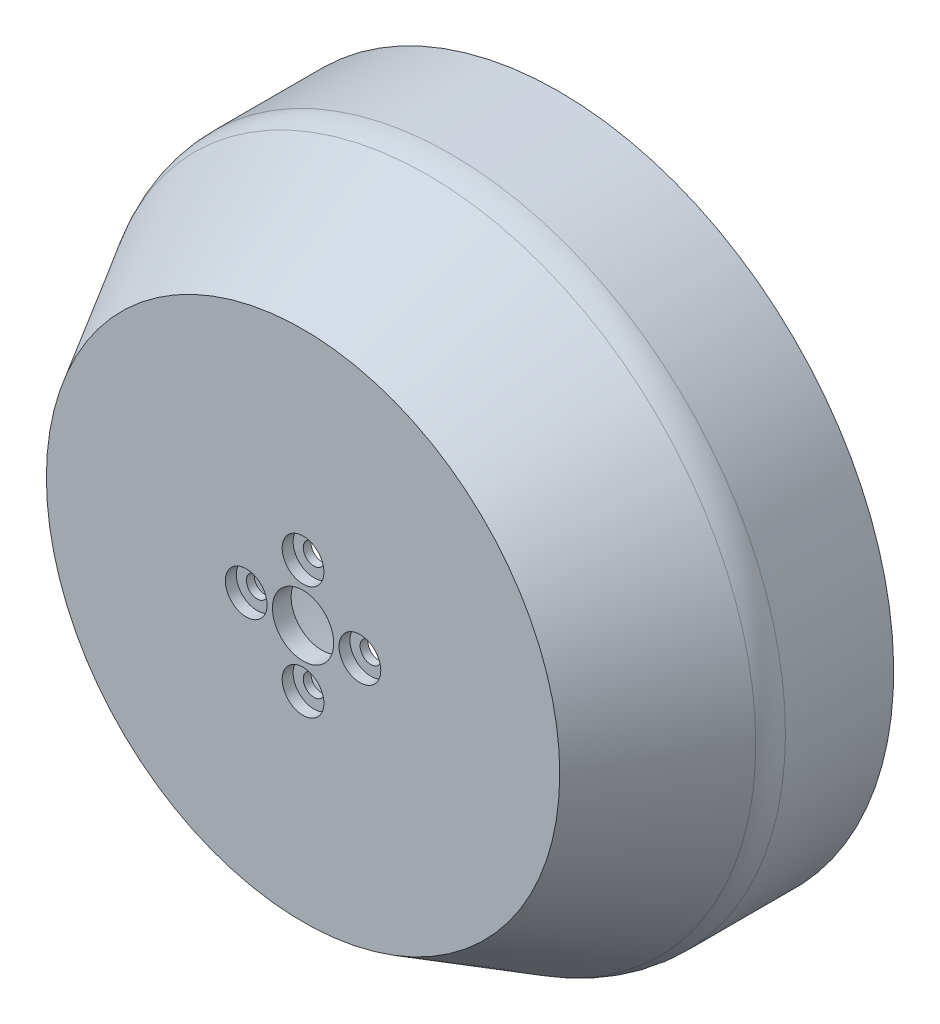
ISO-10303-21;
HEADER;
FILE_DESCRIPTION(('STEP AP214'),'2;1');
FILE_NAME('part.step','',(''),(''),'','','');
FILE_SCHEMA(('AUTOMOTIVE_DESIGN { 1 0 10303 214 1 1 1 1 }'));
ENDSEC;
DATA;
#1=APPLICATION_CONTEXT('core data for automotive mechanical design processes');
#2=APPLICATION_PROTOCOL_DEFINITION('international standard','automotive_design',2000,#1);
#3=PRODUCT_CONTEXT('',#1,'mechanical');
#4=PRODUCT('Part','Part','',(#3));
#5=PRODUCT_RELATED_PRODUCT_CATEGORY('part','',(#4));
#6=PRODUCT_DEFINITION_FORMATION('','',#4);
#7=PRODUCT_DEFINITION_CONTEXT('part definition',#1,'design');
#8=PRODUCT_DEFINITION('design','',#6,#7);
#9=PRODUCT_DEFINITION_SHAPE('','',#8);
#10=(LENGTH_UNIT() NAMED_UNIT(*) SI_UNIT(.MILLI.,.METRE.));
#11=(NAMED_UNIT(*) PLANE_ANGLE_UNIT() SI_UNIT($,.RADIAN.));
#12=(NAMED_UNIT(*) SI_UNIT($,.STERADIAN.) SOLID_ANGLE_UNIT());
#13=UNCERTAINTY_MEASURE_WITH_UNIT(LENGTH_MEASURE(1.E-05),#10,'distance_accuracy_value','');
#14=(GEOMETRIC_REPRESENTATION_CONTEXT(3) GLOBAL_UNCERTAINTY_ASSIGNED_CONTEXT((#13)) GLOBAL_UNIT_ASSIGNED_CONTEXT((#10,
#11,#12)) REPRESENTATION_CONTEXT('',''));
#15=CARTESIAN_POINT('',(0.,0.,0.));
#16=DIRECTION('',(0.,0.,1.));
#17=DIRECTION('',(1.,0.,0.));
#18=AXIS2_PLACEMENT_3D('',#15,#16,#17);
#19=CARTESIAN_POINT('',(16.905,10.,-30.301));
#20=DIRECTION('',(0.,0.,1.));
#21=DIRECTION('',(1.,0.,0.));
#22=AXIS2_PLACEMENT_3D('',#19,#20,#21);
#23=CYLINDRICAL_SURFACE('',#22,1.375);
#24=CARTESIAN_POINT('',(16.905,10.,0.0999999999999994));
#25=DIRECTION('',(0.,0.,1.));
#26=DIRECTION('',(1.,0.,0.));
#27=AXIS2_PLACEMENT_3D('',#24,#25,#26);
#28=CIRCLE('',#27,1.375);
#29=CARTESIAN_POINT('',(18.28,10.,0.0999999999999994));
#30=VERTEX_POINT('',#29);
#31=EDGE_CURVE('E77',#30,#30,#28,.F.);
#32=ORIENTED_EDGE('',*,*,#31,.T.);
#33=EDGE_LOOP('',(#32));
#34=FACE_BOUND('',#33,.T.);
#35=CARTESIAN_POINT('',(16.905,10.,1.1));
#36=DIRECTION('',(0.,0.,1.));
#37=DIRECTION('',(1.,0.,0.));
#38=AXIS2_PLACEMENT_3D('',#35,#36,#37);
#39=CIRCLE('',#38,1.375);
#40=CARTESIAN_POINT('',(18.28,10.,1.1));
#41=VERTEX_POINT('',#40);
#42=EDGE_CURVE('E53',#41,#41,#39,.F.);
#43=ORIENTED_EDGE('',*,*,#42,.F.);
#44=EDGE_LOOP('',(#43));
#45=FACE_BOUND('',#44,.T.);
#46=ADVANCED_FACE('F49',(#34,#45),#23,.F.);
#47=CARTESIAN_POINT('',(9.61999999999999,17.285,-30.301));
#48=DIRECTION('',(0.,0.,1.));
#49=DIRECTION('',(1.,0.,0.));
#50=AXIS2_PLACEMENT_3D('',#47,#48,#49);
#51=CYLINDRICAL_SURFACE('',#50,1.375);
#52=CARTESIAN_POINT('',(9.61999999999999,17.285,0.0999999999999994));
#53=DIRECTION('',(0.,0.,1.));
#54=DIRECTION('',(1.,0.,0.));
#55=AXIS2_PLACEMENT_3D('',#52,#53,#54);
#56=CIRCLE('',#55,1.375);
#57=CARTESIAN_POINT('',(10.995,17.285,0.0999999999999994));
#58=VERTEX_POINT('',#57);
#59=EDGE_CURVE('E81',#58,#58,#56,.F.);
#60=ORIENTED_EDGE('',*,*,#59,.T.);
#61=EDGE_LOOP('',(#60));
#62=FACE_BOUND('',#61,.T.);
#63=CARTESIAN_POINT('',(9.61999999999999,17.285,1.1));
#64=DIRECTION('',(0.,0.,1.));
#65=DIRECTION('',(1.,0.,0.));
#66=AXIS2_PLACEMENT_3D('',#63,#64,#65);
#67=CIRCLE('',#66,1.375);
#68=CARTESIAN_POINT('',(10.995,17.285,1.1));
#69=VERTEX_POINT('',#68);
#70=EDGE_CURVE('E72',#69,#69,#67,.F.);
#71=ORIENTED_EDGE('',*,*,#70,.F.);
#72=EDGE_LOOP('',(#71));
#73=FACE_BOUND('',#72,.T.);
#74=ADVANCED_FACE('F133',(#62,#73),#51,.F.);
#75=CARTESIAN_POINT('',(2.33499999999999,10.,-30.301));
#76=DIRECTION('',(0.,0.,1.));
#77=DIRECTION('',(1.,0.,0.));
#78=AXIS2_PLACEMENT_3D('',#75,#76,#77);
#79=CYLINDRICAL_SURFACE('',#78,1.375);
#80=CARTESIAN_POINT('',(2.33499999999999,10.,0.0999999999999994));
#81=DIRECTION('',(0.,0.,1.));
#82=DIRECTION('',(1.,0.,0.));
#83=AXIS2_PLACEMENT_3D('',#80,#81,#82);
#84=CIRCLE('',#83,1.375);
#85=CARTESIAN_POINT('',(3.70999999999999,10.,0.0999999999999994));
#86=VERTEX_POINT('',#85);
#87=EDGE_CURVE('E86',#86,#86,#84,.F.);
#88=ORIENTED_EDGE('',*,*,#87,.T.);
#89=EDGE_LOOP('',(#88));
#90=FACE_BOUND('',#89,.T.);
#91=CARTESIAN_POINT('',(2.33499999999999,10.,1.1));
#92=DIRECTION('',(0.,0.,1.));
#93=DIRECTION('',(1.,0.,0.));
#94=AXIS2_PLACEMENT_3D('',#91,#92,#93);
#95=CIRCLE('',#94,1.375);
#96=CARTESIAN_POINT('',(3.70999999999999,10.,1.1));
#97=VERTEX_POINT('',#96);
#98=EDGE_CURVE('E69',#97,#97,#95,.F.);
#99=ORIENTED_EDGE('',*,*,#98,.F.);
#100=EDGE_LOOP('',(#99));
#101=FACE_BOUND('',#100,.T.);
#102=ADVANCED_FACE('F138',(#90,#101),#79,.F.);
#103=CARTESIAN_POINT('',(9.61999999999999,2.715,-30.301));
#104=DIRECTION('',(0.,0.,1.));
#105=DIRECTION('',(1.,0.,0.));
#106=AXIS2_PLACEMENT_3D('',#103,#104,#105);
#107=CYLINDRICAL_SURFACE('',#106,1.375);
#108=CARTESIAN_POINT('',(9.61999999999999,2.715,0.0999999999999994));
#109=DIRECTION('',(0.,0.,1.));
#110=DIRECTION('',(1.,0.,0.));
#111=AXIS2_PLACEMENT_3D('',#108,#109,#110);
#112=CIRCLE('',#111,1.375);
#113=CARTESIAN_POINT('',(10.995,2.715,0.0999999999999994));
#114=VERTEX_POINT('',#113);
#115=EDGE_CURVE('E90',#114,#114,#112,.F.);
#116=ORIENTED_EDGE('',*,*,#115,.T.);
#117=EDGE_LOOP('',(#116));
#118=FACE_BOUND('',#117,.T.);
#119=CARTESIAN_POINT('',(9.61999999999999,2.715,1.1));
#120=DIRECTION('',(0.,0.,1.));
#121=DIRECTION('',(1.,0.,0.));
#122=AXIS2_PLACEMENT_3D('',#119,#120,#121);
#123=CIRCLE('',#122,1.375);
#124=CARTESIAN_POINT('',(10.995,2.715,1.1));
#125=VERTEX_POINT('',#124);
#126=EDGE_CURVE('E66',#125,#125,#123,.F.);
#127=ORIENTED_EDGE('',*,*,#126,.F.);
#128=EDGE_LOOP('',(#127));
#129=FACE_BOUND('',#128,.T.);
#130=ADVANCED_FACE('F144',(#118,#129),#107,.F.);
#131=CARTESIAN_POINT('',(9.61999999999999,10.,2.5));
#132=DIRECTION('',(0.,0.,-1.));
#133=DIRECTION('',(-1.,0.,0.));
#134=AXIS2_PLACEMENT_3D('',#131,#132,#133);
#135=CYLINDRICAL_SURFACE('',#134,42.9);
#136=CARTESIAN_POINT('',(9.61999999999999,10.,-16.4282032302755));
#137=DIRECTION('',(0.,0.,1.));
#138=DIRECTION('',(1.,0.,0.));
#139=AXIS2_PLACEMENT_3D('',#136,#137,#138);
#140=CIRCLE('',#139,42.9);
#141=CARTESIAN_POINT('',(52.52,10.,-16.4282032302755));
#142=VERTEX_POINT('',#141);
#143=EDGE_CURVE('E57',#142,#142,#140,.F.);
#144=ORIENTED_EDGE('',*,*,#143,.T.);
#145=EDGE_LOOP('',(#144));
#146=FACE_BOUND('',#145,.T.);
#147=CARTESIAN_POINT('',(9.61999999999999,10.,-30.3));
#148=DIRECTION('',(0.,0.,-1.));
#149=DIRECTION('',(0.,1.,0.));
#150=AXIS2_PLACEMENT_3D('',#147,#148,#149);
#151=CIRCLE('',#150,42.9);
#152=CARTESIAN_POINT('',(9.61999999999999,52.9,-30.3));
#153=VERTEX_POINT('',#152);
#154=EDGE_CURVE('E109',#153,#153,#151,.F.);
#155=ORIENTED_EDGE('',*,*,#154,.T.);
#156=EDGE_LOOP('',(#155));
#157=FACE_BOUND('',#156,.T.);
#158=ADVANCED_FACE('F147',(#146,#157),#135,.T.);
#159=CARTESIAN_POINT('',(9.61999999999999,10.,2.5));
#160=DIRECTION('',(0.,0.,1.));
#161=DIRECTION('',(1.,0.,0.));
#162=AXIS2_PLACEMENT_3D('',#159,#160,#161);
#163=PLANE('',#162);
#164=CARTESIAN_POINT('',(2.33499999999999,10.,2.5));
#165=DIRECTION('',(0.,0.,1.));
#166=DIRECTION('',(1.,0.,0.));
#167=AXIS2_PLACEMENT_3D('',#164,#165,#166);
#168=CIRCLE('',#167,2.675);
#169=CARTESIAN_POINT('',(5.00999999999999,10.,2.5));
#170=VERTEX_POINT('',#169);
#171=EDGE_CURVE('E349',#170,#170,#168,.T.);
#172=ORIENTED_EDGE('',*,*,#171,.F.);
#173=EDGE_LOOP('',(#172));
#174=FACE_BOUND('',#173,.T.);
#175=CARTESIAN_POINT('',(9.61999999999999,2.715,2.5));
#176=DIRECTION('',(0.,0.,1.));
#177=DIRECTION('',(1.,0.,0.));
#178=AXIS2_PLACEMENT_3D('',#175,#176,#177);
#179=CIRCLE('',#178,2.675);
#180=CARTESIAN_POINT('',(12.295,2.715,2.5));
#181=VERTEX_POINT('',#180);
#182=EDGE_CURVE('E343',#181,#181,#179,.T.);
#183=ORIENTED_EDGE('',*,*,#182,.F.);
#184=EDGE_LOOP('',(#183));
#185=FACE_BOUND('',#184,.T.);
#186=CARTESIAN_POINT('',(9.61999999999999,17.285,2.5));
#187=DIRECTION('',(0.,0.,1.));
#188=DIRECTION('',(1.,0.,0.));
#189=AXIS2_PLACEMENT_3D('',#186,#187,#188);
#190=CIRCLE('',#189,2.675);
#191=CARTESIAN_POINT('',(12.295,17.285,2.5));
#192=VERTEX_POINT('',#191);
#193=EDGE_CURVE('E338',#192,#192,#190,.T.);
#194=ORIENTED_EDGE('',*,*,#193,.F.);
#195=EDGE_LOOP('',(#194));
#196=FACE_BOUND('',#195,.T.);
#197=CARTESIAN_POINT('',(16.905,10.,2.5));
#198=DIRECTION('',(0.,0.,1.));
#199=DIRECTION('',(1.,0.,0.));
#200=AXIS2_PLACEMENT_3D('',#197,#198,#199);
#201=CIRCLE('',#200,2.675);
#202=CARTESIAN_POINT('',(19.58,10.,2.5));
#203=VERTEX_POINT('',#202);
#204=EDGE_CURVE('E335',#203,#203,#201,.T.);
#205=ORIENTED_EDGE('',*,*,#204,.F.);
#206=EDGE_LOOP('',(#205));
#207=FACE_BOUND('',#206,.T.);
#208=CARTESIAN_POINT('',(9.61999999999999,10.,2.5));
#209=DIRECTION('',(0.,0.,1.));
#210=DIRECTION('',(1.,0.,0.));
#211=AXIS2_PLACEMENT_3D('',#208,#209,#210);
#212=CIRCLE('',#211,3.925);
#213=CARTESIAN_POINT('',(13.545,10.,2.5));
#214=VERTEX_POINT('',#213);
#215=EDGE_CURVE('E93',#214,#214,#212,.T.);
#216=ORIENTED_EDGE('',*,*,#215,.F.);
#217=EDGE_LOOP('',(#216));
#218=FACE_BOUND('',#217,.T.);
#219=CARTESIAN_POINT('',(9.61999999999999,10.,2.5));
#220=DIRECTION('',(0.,0.,1.));
#221=DIRECTION('',(1.,0.,0.));
#222=AXIS2_PLACEMENT_3D('',#219,#220,#221);
#223=CIRCLE('',#222,32.9);
#224=CARTESIAN_POINT('',(42.52,10.,2.5));
#225=VERTEX_POINT('',#224);
#226=EDGE_CURVE('E62',#225,#225,#223,.T.);
#227=ORIENTED_EDGE('',*,*,#226,.T.);
#228=EDGE_LOOP('',(#227));
#229=FACE_BOUND('',#228,.T.);
#230=ADVANCED_FACE('F118',(#174,#185,#196,#207,#218,#229),#163,.T.);
#231=CARTESIAN_POINT('',(9.61999999999999,10.,-30.3));
#232=DIRECTION('',(0.,0.,-1.));
#233=DIRECTION('',(-1.,0.,0.));
#234=AXIS2_PLACEMENT_3D('',#231,#232,#233);
#235=PLANE('',#234);
#236=CARTESIAN_POINT('',(9.61999999999999,10.,-30.3));
#237=DIRECTION('',(0.,0.,-1.));
#238=DIRECTION('',(0.,1.,0.));
#239=AXIS2_PLACEMENT_3D('',#236,#237,#238);
#240=CIRCLE('',#239,40.5);
#241=CARTESIAN_POINT('',(9.61999999999999,50.5,-30.3));
#242=VERTEX_POINT('',#241);
#243=EDGE_CURVE('E101',#242,#242,#240,.F.);
#244=ORIENTED_EDGE('',*,*,#243,.T.);
#245=EDGE_LOOP('',(#244));
#246=FACE_BOUND('',#245,.T.);
#247=ORIENTED_EDGE('',*,*,#154,.F.);
#248=EDGE_LOOP('',(#247));
#249=FACE_BOUND('',#248,.T.);
#250=ADVANCED_FACE('F122',(#246,#249),#235,.T.);
#251=CARTESIAN_POINT('',(9.61999999999999,10.,2.5));
#252=DIRECTION('',(0.,0.,-1.));
#253=DIRECTION('',(-1.,0.,0.));
#254=AXIS2_PLACEMENT_3D('',#251,#252,#253);
#255=CONICAL_SURFACE('',#254,32.9,0.5235987755983);
#256=CARTESIAN_POINT('',(9.61999999999999,10.,-13.4282032302755));
#257=DIRECTION('',(0.,0.,-1.));
#258=DIRECTION('',(-1.,0.,0.));
#259=AXIS2_PLACEMENT_3D('',#256,#257,#258);
#260=CIRCLE('',#259,42.0961524227066);
#261=CARTESIAN_POINT('',(-32.4761524227066,10.,-13.4282032302755));
#262=VERTEX_POINT('',#261);
#263=EDGE_CURVE('E14',#262,#262,#260,.F.);
#264=ORIENTED_EDGE('',*,*,#263,.T.);
#265=EDGE_LOOP('',(#264));
#266=FACE_BOUND('',#265,.T.);
#267=ORIENTED_EDGE('',*,*,#226,.F.);
#268=EDGE_LOOP('',(#267));
#269=FACE_BOUND('',#268,.T.);
#270=ADVANCED_FACE('F120',(#266,#269),#255,.T.);
#271=CARTESIAN_POINT('',(9.61999999999999,10.,-16.4282032302755));
#272=DIRECTION('',(0.,0.,1.));
#273=DIRECTION('',(1.,0.,0.));
#274=AXIS2_PLACEMENT_3D('',#271,#272,#273);
#275=TOROIDAL_SURFACE('',#274,36.9,6.);
#276=ORIENTED_EDGE('',*,*,#263,.F.);
#277=EDGE_LOOP('',(#276));
#278=FACE_BOUND('',#277,.T.);
#279=ORIENTED_EDGE('',*,*,#143,.F.);
#280=EDGE_LOOP('',(#279));
#281=FACE_BOUND('',#280,.T.);
#282=ADVANCED_FACE('F51',(#278,#281),#275,.T.);
#283=CARTESIAN_POINT('',(9.61999999999999,10.,2.5));
#284=DIRECTION('',(0.,0.,-1.));
#285=DIRECTION('',(-1.,0.,0.));
#286=AXIS2_PLACEMENT_3D('',#283,#284,#285);
#287=CYLINDRICAL_SURFACE('',#286,40.5);
#288=CARTESIAN_POINT('',(9.61999999999999,10.,-16.4282032302755));
#289=DIRECTION('',(0.,0.,-1.));
#290=DIRECTION('',(-1.,0.,0.));
#291=AXIS2_PLACEMENT_3D('',#288,#289,#290);
#292=CIRCLE('',#291,40.5);
#293=CARTESIAN_POINT('',(-30.88,10.,-16.4282032302755));
#294=VERTEX_POINT('',#293);
#295=EDGE_CURVE('E102',#294,#294,#292,.T.);
#296=ORIENTED_EDGE('',*,*,#295,.F.);
#297=EDGE_LOOP('',(#296));
#298=FACE_BOUND('',#297,.T.);
#299=ORIENTED_EDGE('',*,*,#243,.F.);
#300=EDGE_LOOP('',(#299));
#301=FACE_BOUND('',#300,.T.);
#302=ADVANCED_FACE('F127',(#298,#301),#287,.F.);
#303=CARTESIAN_POINT('',(9.61999999999999,10.,0.1));
#304=DIRECTION('',(0.,0.,1.));
#305=DIRECTION('',(1.,0.,0.));
#306=AXIS2_PLACEMENT_3D('',#303,#304,#305);
#307=PLANE('',#306);
#308=ORIENTED_EDGE('',*,*,#115,.F.);
#309=EDGE_LOOP('',(#308));
#310=FACE_BOUND('',#309,.T.);
#311=ORIENTED_EDGE('',*,*,#87,.F.);
#312=EDGE_LOOP('',(#311));
#313=FACE_BOUND('',#312,.T.);
#314=ORIENTED_EDGE('',*,*,#59,.F.);
#315=EDGE_LOOP('',(#314));
#316=FACE_BOUND('',#315,.T.);
#317=ORIENTED_EDGE('',*,*,#31,.F.);
#318=EDGE_LOOP('',(#317));
#319=FACE_BOUND('',#318,.T.);
#320=CARTESIAN_POINT('',(9.61999999999999,10.,0.0999999999999994));
#321=DIRECTION('',(0.,0.,1.));
#322=DIRECTION('',(1.,0.,0.));
#323=AXIS2_PLACEMENT_3D('',#320,#321,#322);
#324=CIRCLE('',#323,3.925);
#325=CARTESIAN_POINT('',(13.545,10.,0.0999999999999994));
#326=VERTEX_POINT('',#325);
#327=EDGE_CURVE('E98',#326,#326,#324,.F.);
#328=ORIENTED_EDGE('',*,*,#327,.F.);
#329=EDGE_LOOP('',(#328));
#330=FACE_BOUND('',#329,.T.);
#331=CARTESIAN_POINT('',(9.61999999999999,10.,0.1));
#332=DIRECTION('',(0.,0.,1.));
#333=DIRECTION('',(1.,0.,0.));
#334=AXIS2_PLACEMENT_3D('',#331,#332,#333);
#335=CIRCLE('',#334,31.5143593539449);
#336=CARTESIAN_POINT('',(41.1343593539449,10.,0.1));
#337=VERTEX_POINT('',#336);
#338=EDGE_CURVE('E106',#337,#337,#335,.T.);
#339=ORIENTED_EDGE('',*,*,#338,.F.);
#340=EDGE_LOOP('',(#339));
#341=FACE_BOUND('',#340,.T.);
#342=ADVANCED_FACE('F160',(#310,#313,#316,#319,#330,#341),#307,.F.);
#343=CARTESIAN_POINT('',(9.61999999999999,10.,1.3));
#344=DIRECTION('',(0.,0.,-1.));
#345=DIRECTION('',(-1.,0.,0.));
#346=AXIS2_PLACEMENT_3D('',#343,#344,#345);
#347=CONICAL_SURFACE('',#346,30.8215390309173,0.5235987755983);
#348=CARTESIAN_POINT('',(9.61999999999999,10.,-14.6282032302755));
#349=DIRECTION('',(0.,0.,-1.));
#350=DIRECTION('',(-1.,0.,0.));
#351=AXIS2_PLACEMENT_3D('',#348,#349,#350);
#352=CIRCLE('',#351,40.017691453624);
#353=CARTESIAN_POINT('',(-30.397691453624,10.,-14.6282032302755));
#354=VERTEX_POINT('',#353);
#355=EDGE_CURVE('E105',#354,#354,#352,.F.);
#356=ORIENTED_EDGE('',*,*,#355,.F.);
#357=EDGE_LOOP('',(#356));
#358=FACE_BOUND('',#357,.T.);
#359=ORIENTED_EDGE('',*,*,#338,.T.);
#360=EDGE_LOOP('',(#359));
#361=FACE_BOUND('',#360,.T.);
#362=ADVANCED_FACE('F164',(#358,#361),#347,.F.);
#363=CARTESIAN_POINT('',(9.61999999999999,10.,-16.4282032302755));
#364=DIRECTION('',(0.,0.,1.));
#365=DIRECTION('',(1.,0.,0.));
#366=AXIS2_PLACEMENT_3D('',#363,#364,#365);
#367=TOROIDAL_SURFACE('',#366,36.9,3.6);
#368=ORIENTED_EDGE('',*,*,#355,.T.);
#369=EDGE_LOOP('',(#368));
#370=FACE_BOUND('',#369,.T.);
#371=ORIENTED_EDGE('',*,*,#295,.T.);
#372=EDGE_LOOP('',(#371));
#373=FACE_BOUND('',#372,.T.);
#374=ADVANCED_FACE('F156',(#370,#373),#367,.F.);
#375=CARTESIAN_POINT('',(9.61999999999999,10.,-30.301));
#376=DIRECTION('',(0.,0.,1.));
#377=DIRECTION('',(1.,0.,0.));
#378=AXIS2_PLACEMENT_3D('',#375,#376,#377);
#379=CYLINDRICAL_SURFACE('',#378,3.925);
#380=ORIENTED_EDGE('',*,*,#215,.T.);
#381=EDGE_LOOP('',(#380));
#382=FACE_BOUND('',#381,.T.);
#383=ORIENTED_EDGE('',*,*,#327,.T.);
#384=EDGE_LOOP('',(#383));
#385=FACE_BOUND('',#384,.T.);
#386=ADVANCED_FACE('F152',(#382,#385),#379,.F.);
#387=CARTESIAN_POINT('',(9.61999999999999,10.,1.1));
#388=DIRECTION('',(0.,0.,1.));
#389=DIRECTION('',(1.,0.,0.));
#390=AXIS2_PLACEMENT_3D('',#387,#388,#389);
#391=PLANE('',#390);
#392=CARTESIAN_POINT('',(9.61999999999999,2.715,1.1));
#393=DIRECTION('',(0.,0.,1.));
#394=DIRECTION('',(1.,0.,0.));
#395=AXIS2_PLACEMENT_3D('',#392,#393,#394);
#396=CIRCLE('',#395,2.675);
#397=CARTESIAN_POINT('',(12.295,2.715,1.1));
#398=VERTEX_POINT('',#397);
#399=EDGE_CURVE('E346',#398,#398,#396,.F.);
#400=ORIENTED_EDGE('',*,*,#399,.F.);
#401=EDGE_LOOP('',(#400));
#402=FACE_BOUND('',#401,.T.);
#403=ORIENTED_EDGE('',*,*,#126,.T.);
#404=EDGE_LOOP('',(#403));
#405=FACE_BOUND('',#404,.T.);
#406=ADVANCED_FACE('F155',(#402,#405),#391,.T.);
#407=CARTESIAN_POINT('',(9.61999999999999,2.715,-7.46604255869606));
#408=DIRECTION('',(0.,0.,1.));
#409=DIRECTION('',(1.,0.,0.));
#410=AXIS2_PLACEMENT_3D('',#407,#408,#409);
#411=CYLINDRICAL_SURFACE('',#410,2.675);
#412=ORIENTED_EDGE('',*,*,#399,.T.);
#413=EDGE_LOOP('',(#412));
#414=FACE_BOUND('',#413,.T.);
#415=ORIENTED_EDGE('',*,*,#182,.T.);
#416=EDGE_LOOP('',(#415));
#417=FACE_BOUND('',#416,.T.);
#418=ADVANCED_FACE('F257',(#414,#417),#411,.F.);
#419=CARTESIAN_POINT('',(9.61999999999999,10.,1.1));
#420=DIRECTION('',(0.,0.,1.));
#421=DIRECTION('',(1.,0.,0.));
#422=AXIS2_PLACEMENT_3D('',#419,#420,#421);
#423=PLANE('',#422);
#424=CARTESIAN_POINT('',(2.33499999999999,10.,1.1));
#425=DIRECTION('',(0.,0.,1.));
#426=DIRECTION('',(1.,0.,0.));
#427=AXIS2_PLACEMENT_3D('',#424,#425,#426);
#428=CIRCLE('',#427,2.675);
#429=CARTESIAN_POINT('',(5.00999999999999,10.,1.1));
#430=VERTEX_POINT('',#429);
#431=EDGE_CURVE('E70',#430,#430,#428,.F.);
#432=ORIENTED_EDGE('',*,*,#431,.F.);
#433=EDGE_LOOP('',(#432));
#434=FACE_BOUND('',#433,.T.);
#435=ORIENTED_EDGE('',*,*,#98,.T.);
#436=EDGE_LOOP('',(#435));
#437=FACE_BOUND('',#436,.T.);
#438=ADVANCED_FACE('F266',(#434,#437),#423,.T.);
#439=CARTESIAN_POINT('',(2.33499999999999,10.,-7.46604255869606));
#440=DIRECTION('',(0.,0.,1.));
#441=DIRECTION('',(1.,0.,0.));
#442=AXIS2_PLACEMENT_3D('',#439,#440,#441);
#443=CYLINDRICAL_SURFACE('',#442,2.675);
#444=ORIENTED_EDGE('',*,*,#431,.T.);
#445=EDGE_LOOP('',(#444));
#446=FACE_BOUND('',#445,.T.);
#447=ORIENTED_EDGE('',*,*,#171,.T.);
#448=EDGE_LOOP('',(#447));
#449=FACE_BOUND('',#448,.T.);
#450=ADVANCED_FACE('F275',(#446,#449),#443,.F.);
#451=CARTESIAN_POINT('',(9.61999999999999,10.,1.1));
#452=DIRECTION('',(0.,0.,1.));
#453=DIRECTION('',(1.,0.,0.));
#454=AXIS2_PLACEMENT_3D('',#451,#452,#453);
#455=PLANE('',#454);
#456=CARTESIAN_POINT('',(9.61999999999999,17.285,1.1));
#457=DIRECTION('',(0.,0.,1.));
#458=DIRECTION('',(1.,0.,0.));
#459=AXIS2_PLACEMENT_3D('',#456,#457,#458);
#460=CIRCLE('',#459,2.675);
#461=CARTESIAN_POINT('',(12.295,17.285,1.1));
#462=VERTEX_POINT('',#461);
#463=EDGE_CURVE('E340',#462,#462,#460,.F.);
#464=ORIENTED_EDGE('',*,*,#463,.F.);
#465=EDGE_LOOP('',(#464));
#466=FACE_BOUND('',#465,.T.);
#467=ORIENTED_EDGE('',*,*,#70,.T.);
#468=EDGE_LOOP('',(#467));
#469=FACE_BOUND('',#468,.T.);
#470=ADVANCED_FACE('F284',(#466,#469),#455,.T.);
#471=CARTESIAN_POINT('',(9.61999999999999,17.285,-7.46604255869606));
#472=DIRECTION('',(0.,0.,1.));
#473=DIRECTION('',(1.,0.,0.));
#474=AXIS2_PLACEMENT_3D('',#471,#472,#473);
#475=CYLINDRICAL_SURFACE('',#474,2.675);
#476=ORIENTED_EDGE('',*,*,#463,.T.);
#477=EDGE_LOOP('',(#476));
#478=FACE_BOUND('',#477,.T.);
#479=ORIENTED_EDGE('',*,*,#193,.T.);
#480=EDGE_LOOP('',(#479));
#481=FACE_BOUND('',#480,.T.);
#482=ADVANCED_FACE('F293',(#478,#481),#475,.F.);
#483=CARTESIAN_POINT('',(9.61999999999999,10.,1.1));
#484=DIRECTION('',(0.,0.,1.));
#485=DIRECTION('',(1.,0.,0.));
#486=AXIS2_PLACEMENT_3D('',#483,#484,#485);
#487=PLANE('',#486);
#488=CARTESIAN_POINT('',(16.905,10.,1.1));
#489=DIRECTION('',(0.,0.,1.));
#490=DIRECTION('',(1.,0.,0.));
#491=AXIS2_PLACEMENT_3D('',#488,#489,#490);
#492=CIRCLE('',#491,2.675);
#493=CARTESIAN_POINT('',(19.58,10.,1.1));
#494=VERTEX_POINT('',#493);
#495=EDGE_CURVE('E332',#494,#494,#492,.F.);
#496=ORIENTED_EDGE('',*,*,#495,.F.);
#497=EDGE_LOOP('',(#496));
#498=FACE_BOUND('',#497,.T.);
#499=ORIENTED_EDGE('',*,*,#42,.T.);
#500=EDGE_LOOP('',(#499));
#501=FACE_BOUND('',#500,.T.);
#502=ADVANCED_FACE('F302',(#498,#501),#487,.T.);
#503=CARTESIAN_POINT('',(16.905,10.,-7.46604255869606));
#504=DIRECTION('',(0.,0.,1.));
#505=DIRECTION('',(1.,0.,0.));
#506=AXIS2_PLACEMENT_3D('',#503,#504,#505);
#507=CYLINDRICAL_SURFACE('',#506,2.675);
#508=ORIENTED_EDGE('',*,*,#495,.T.);
#509=EDGE_LOOP('',(#508));
#510=FACE_BOUND('',#509,.T.);
#511=ORIENTED_EDGE('',*,*,#204,.T.);
#512=EDGE_LOOP('',(#511));
#513=FACE_BOUND('',#512,.T.);
#514=ADVANCED_FACE('F311',(#510,#513),#507,.F.);
#515=CLOSED_SHELL('',(#46,#74,#102,#130,#158,#230,#250,#270,#282,#302,#342,#362,#374,#386,#406,
#418,#438,#450,#470,#482,#502,#514));
#516=MANIFOLD_SOLID_BREP('B2',#515);
#517=ADVANCED_BREP_SHAPE_REPRESENTATION('',(#18,#516),#14);
#518=SHAPE_DEFINITION_REPRESENTATION(#9,#517);
ENDSEC;
END-ISO-10303-21;
